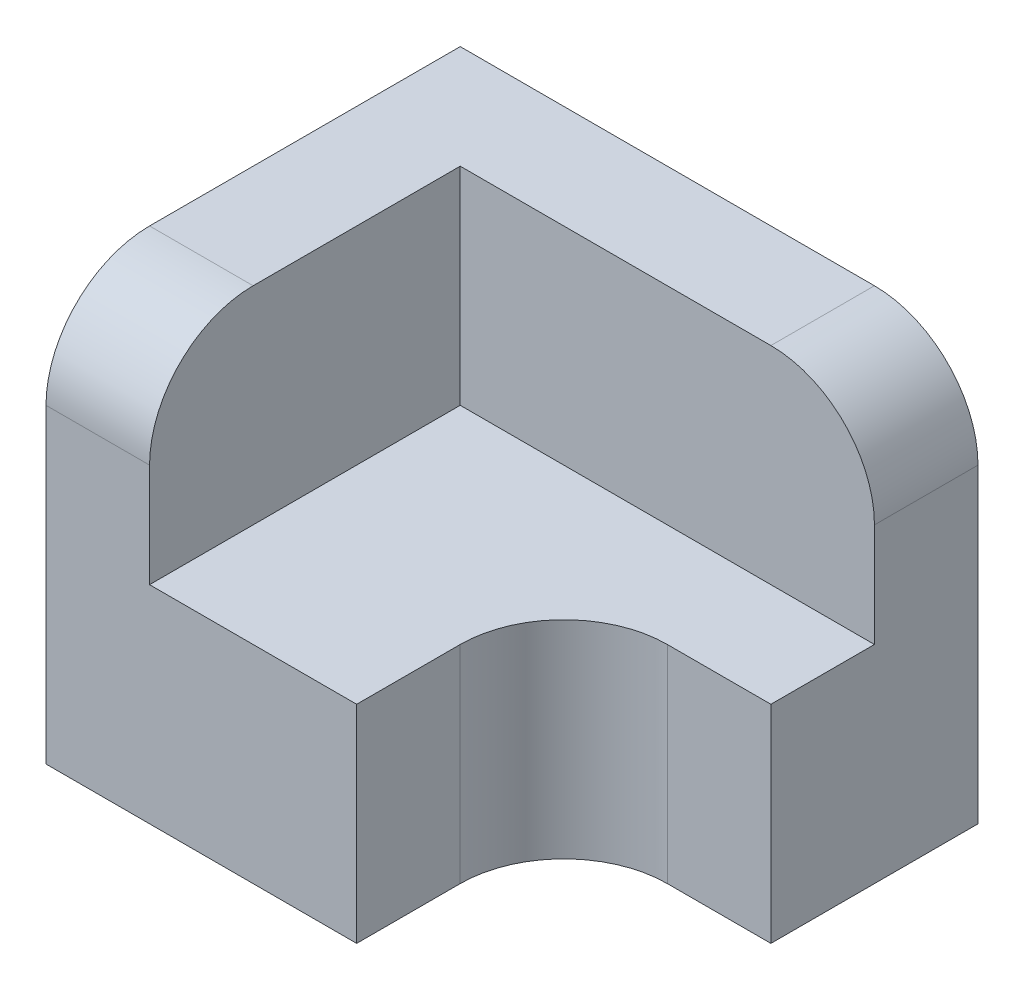
ISO-10303-21;
HEADER;
FILE_DESCRIPTION(('STEP AP214'),'2;1');
FILE_NAME('part.step','',(''),(''),'','','');
FILE_SCHEMA(('AUTOMOTIVE_DESIGN { 1 0 10303 214 1 1 1 1 }'));
ENDSEC;
DATA;
#1=APPLICATION_CONTEXT('core data for automotive mechanical design processes');
#2=APPLICATION_PROTOCOL_DEFINITION('international standard','automotive_design',2000,#1);
#3=PRODUCT_CONTEXT('',#1,'mechanical');
#4=PRODUCT('Part','Part','',(#3));
#5=PRODUCT_RELATED_PRODUCT_CATEGORY('part','',(#4));
#6=PRODUCT_DEFINITION_FORMATION('','',#4);
#7=PRODUCT_DEFINITION_CONTEXT('part definition',#1,'design');
#8=PRODUCT_DEFINITION('design','',#6,#7);
#9=PRODUCT_DEFINITION_SHAPE('','',#8);
#10=(LENGTH_UNIT() NAMED_UNIT(*) SI_UNIT(.MILLI.,.METRE.));
#11=(NAMED_UNIT(*) PLANE_ANGLE_UNIT() SI_UNIT($,.RADIAN.));
#12=(NAMED_UNIT(*) SI_UNIT($,.STERADIAN.) SOLID_ANGLE_UNIT());
#13=UNCERTAINTY_MEASURE_WITH_UNIT(LENGTH_MEASURE(1.E-05),#10,'distance_accuracy_value','');
#14=(GEOMETRIC_REPRESENTATION_CONTEXT(3) GLOBAL_UNCERTAINTY_ASSIGNED_CONTEXT((#13)) GLOBAL_UNIT_ASSIGNED_CONTEXT((#10,
#11,#12)) REPRESENTATION_CONTEXT('',''));
#15=CARTESIAN_POINT('',(0.,0.,0.));
#16=DIRECTION('',(0.,0.,1.));
#17=DIRECTION('',(1.,0.,0.));
#18=AXIS2_PLACEMENT_3D('',#15,#16,#17);
#19=CARTESIAN_POINT('',(0.,10.,0.));
#20=DIRECTION('',(0.,1.,0.));
#21=DIRECTION('',(0.,0.,1.));
#22=AXIS2_PLACEMENT_3D('',#19,#20,#21);
#23=PLANE('',#22);
#24=DIRECTION('',(-1.,0.,0.));
#25=VECTOR('',#24,1.);
#26=CARTESIAN_POINT('',(0.,10.,-5.));
#27=LINE('',#26,#25);
#28=CARTESIAN_POINT('',(12.5,10.,-5.));
#29=VERTEX_POINT('',#28);
#30=CARTESIAN_POINT('',(-7.5,10.,-5.));
#31=VERTEX_POINT('',#30);
#32=EDGE_CURVE('E151',#29,#31,#27,.T.);
#33=ORIENTED_EDGE('',*,*,#32,.T.);
#34=DIRECTION('',(0.,0.,1.));
#35=VECTOR('',#34,1.);
#36=CARTESIAN_POINT('',(-7.5,10.,0.));
#37=LINE('',#36,#35);
#38=CARTESIAN_POINT('',(-7.5,10.,10.));
#39=VERTEX_POINT('',#38);
#40=EDGE_CURVE('E150',#31,#39,#37,.T.);
#41=ORIENTED_EDGE('',*,*,#40,.T.);
#42=DIRECTION('',(1.,0.,0.));
#43=VECTOR('',#42,1.);
#44=CARTESIAN_POINT('',(0.,10.,10.));
#45=LINE('',#44,#43);
#46=CARTESIAN_POINT('',(2.5,10.,10.));
#47=VERTEX_POINT('',#46);
#48=EDGE_CURVE('E164',#39,#47,#45,.T.);
#49=ORIENTED_EDGE('',*,*,#48,.T.);
#50=DIRECTION('',(0.,0.,-1.));
#51=VECTOR('',#50,1.);
#52=CARTESIAN_POINT('',(2.5,10.,0.));
#53=LINE('',#52,#51);
#54=CARTESIAN_POINT('',(2.5,10.,5.00000000000004));
#55=VERTEX_POINT('',#54);
#56=EDGE_CURVE('E167',#47,#55,#53,.T.);
#57=ORIENTED_EDGE('',*,*,#56,.T.);
#58=CARTESIAN_POINT('',(7.5,10.,5.));
#59=DIRECTION('',(0.,1.,0.));
#60=DIRECTION('',(0.,0.,1.));
#61=AXIS2_PLACEMENT_3D('',#58,#59,#60);
#62=CIRCLE('',#61,5.);
#63=CARTESIAN_POINT('',(7.50000000000003,10.,0.));
#64=VERTEX_POINT('',#63);
#65=EDGE_CURVE('E169',#55,#64,#62,.F.);
#66=ORIENTED_EDGE('',*,*,#65,.T.);
#67=DIRECTION('',(-1.,0.,0.));
#68=VECTOR('',#67,1.);
#69=CARTESIAN_POINT('',(0.,10.,0.));
#70=LINE('',#69,#68);
#71=CARTESIAN_POINT('',(12.5,10.,0.));
#72=VERTEX_POINT('',#71);
#73=EDGE_CURVE('E171',#72,#64,#70,.T.);
#74=ORIENTED_EDGE('',*,*,#73,.F.);
#75=DIRECTION('',(0.,0.,-1.));
#76=VECTOR('',#75,1.);
#77=CARTESIAN_POINT('',(12.5,10.,0.));
#78=LINE('',#77,#76);
#79=EDGE_CURVE('E161',#72,#29,#78,.T.);
#80=ORIENTED_EDGE('',*,*,#79,.T.);
#81=EDGE_LOOP('',(#33,#41,#49,#57,#66,#74,#80));
#82=FACE_BOUND('',#81,.T.);
#83=ADVANCED_FACE('F39',(#82),#23,.T.);
#84=CARTESIAN_POINT('',(12.5,10.,0.));
#85=DIRECTION('',(-1.,0.,0.));
#86=DIRECTION('',(0.,0.,1.));
#87=AXIS2_PLACEMENT_3D('',#84,#85,#86);
#88=PLANE('',#87);
#89=DIRECTION('',(0.,-1.,0.));
#90=VECTOR('',#89,1.);
#91=CARTESIAN_POINT('',(12.5,10.,-10.));
#92=LINE('',#91,#90);
#93=CARTESIAN_POINT('',(12.5,15.,-10.));
#94=VERTEX_POINT('',#93);
#95=CARTESIAN_POINT('',(12.5,0.,-10.));
#96=VERTEX_POINT('',#95);
#97=EDGE_CURVE('E205',#94,#96,#92,.T.);
#98=ORIENTED_EDGE('',*,*,#97,.F.);
#99=DIRECTION('',(0.,0.,-1.));
#100=VECTOR('',#99,1.);
#101=CARTESIAN_POINT('',(12.5,15.,-5.));
#102=LINE('',#101,#100);
#103=CARTESIAN_POINT('',(12.5,15.,-5.));
#104=VERTEX_POINT('',#103);
#105=EDGE_CURVE('E47',#94,#104,#102,.F.);
#106=ORIENTED_EDGE('',*,*,#105,.T.);
#107=DIRECTION('',(0.,-1.,0.));
#108=VECTOR('',#107,1.);
#109=CARTESIAN_POINT('',(12.5,20.,-5.));
#110=LINE('',#109,#108);
#111=EDGE_CURVE('E152',#104,#29,#110,.T.);
#112=ORIENTED_EDGE('',*,*,#111,.T.);
#113=ORIENTED_EDGE('',*,*,#79,.F.);
#114=DIRECTION('',(0.,-1.,0.));
#115=VECTOR('',#114,1.);
#116=CARTESIAN_POINT('',(12.5,10.,0.));
#117=LINE('',#116,#115);
#118=CARTESIAN_POINT('',(12.5,0.,0.));
#119=VERTEX_POINT('',#118);
#120=EDGE_CURVE('E174',#72,#119,#117,.T.);
#121=ORIENTED_EDGE('',*,*,#120,.T.);
#122=DIRECTION('',(0.,0.,-1.));
#123=VECTOR('',#122,1.);
#124=CARTESIAN_POINT('',(12.5,0.,0.));
#125=LINE('',#124,#123);
#126=EDGE_CURVE('E160',#119,#96,#125,.T.);
#127=ORIENTED_EDGE('',*,*,#126,.T.);
#128=EDGE_LOOP('',(#98,#106,#112,#113,#121,#127));
#129=FACE_BOUND('',#128,.T.);
#130=ADVANCED_FACE('F257',(#129),#88,.F.);
#131=CARTESIAN_POINT('',(0.,10.,-10.));
#132=DIRECTION('',(0.,0.,-1.));
#133=DIRECTION('',(-1.,0.,0.));
#134=AXIS2_PLACEMENT_3D('',#131,#132,#133);
#135=PLANE('',#134);
#136=DIRECTION('',(1.,0.,0.));
#137=VECTOR('',#136,1.);
#138=CARTESIAN_POINT('',(0.,20.,-10.));
#139=LINE('',#138,#137);
#140=CARTESIAN_POINT('',(-12.5,20.,-10.));
#141=VERTEX_POINT('',#140);
#142=CARTESIAN_POINT('',(7.5,20.,-10.));
#143=VERTEX_POINT('',#142);
#144=EDGE_CURVE('E145',#141,#143,#139,.T.);
#145=ORIENTED_EDGE('',*,*,#144,.T.);
#146=CARTESIAN_POINT('',(7.5,15.,-10.));
#147=DIRECTION('',(0.,0.,-1.));
#148=DIRECTION('',(-1.,0.,0.));
#149=AXIS2_PLACEMENT_3D('',#146,#147,#148);
#150=CIRCLE('',#149,5.);
#151=EDGE_CURVE('E61',#143,#94,#150,.T.);
#152=ORIENTED_EDGE('',*,*,#151,.T.);
#153=ORIENTED_EDGE('',*,*,#97,.T.);
#154=DIRECTION('',(1.,0.,0.));
#155=VECTOR('',#154,1.);
#156=CARTESIAN_POINT('',(0.,0.,-10.));
#157=LINE('',#156,#155);
#158=CARTESIAN_POINT('',(-12.5,0.,-10.));
#159=VERTEX_POINT('',#158);
#160=EDGE_CURVE('E177',#159,#96,#157,.T.);
#161=ORIENTED_EDGE('',*,*,#160,.F.);
#162=DIRECTION('',(0.,-1.,0.));
#163=VECTOR('',#162,1.);
#164=CARTESIAN_POINT('',(-12.5,10.,-10.));
#165=LINE('',#164,#163);
#166=EDGE_CURVE('E203',#141,#159,#165,.T.);
#167=ORIENTED_EDGE('',*,*,#166,.F.);
#168=EDGE_LOOP('',(#145,#152,#153,#161,#167));
#169=FACE_BOUND('',#168,.T.);
#170=ADVANCED_FACE('F234',(#169),#135,.T.);
#171=CARTESIAN_POINT('',(-12.5,10.,0.));
#172=DIRECTION('',(-1.,0.,0.));
#173=DIRECTION('',(0.,0.,1.));
#174=AXIS2_PLACEMENT_3D('',#171,#172,#173);
#175=PLANE('',#174);
#176=DIRECTION('',(0.,-1.,0.));
#177=VECTOR('',#176,1.);
#178=CARTESIAN_POINT('',(-12.5,10.,10.));
#179=LINE('',#178,#177);
#180=CARTESIAN_POINT('',(-12.5,15.,10.));
#181=VERTEX_POINT('',#180);
#182=CARTESIAN_POINT('',(-12.5,0.,10.));
#183=VERTEX_POINT('',#182);
#184=EDGE_CURVE('E201',#181,#183,#179,.T.);
#185=ORIENTED_EDGE('',*,*,#184,.F.);
#186=CARTESIAN_POINT('',(-12.5,15.,5.));
#187=DIRECTION('',(-1.,0.,0.));
#188=DIRECTION('',(0.,0.,1.));
#189=AXIS2_PLACEMENT_3D('',#186,#187,#188);
#190=CIRCLE('',#189,5.);
#191=CARTESIAN_POINT('',(-12.5,20.,5.));
#192=VERTEX_POINT('',#191);
#193=EDGE_CURVE('E214',#181,#192,#190,.T.);
#194=ORIENTED_EDGE('',*,*,#193,.T.);
#195=DIRECTION('',(0.,0.,-1.));
#196=VECTOR('',#195,1.);
#197=CARTESIAN_POINT('',(-12.5,20.,0.));
#198=LINE('',#197,#196);
#199=EDGE_CURVE('E220',#192,#141,#198,.T.);
#200=ORIENTED_EDGE('',*,*,#199,.T.);
#201=ORIENTED_EDGE('',*,*,#166,.T.);
#202=DIRECTION('',(0.,0.,-1.));
#203=VECTOR('',#202,1.);
#204=CARTESIAN_POINT('',(-12.5,0.,0.));
#205=LINE('',#204,#203);
#206=EDGE_CURVE('E180',#183,#159,#205,.T.);
#207=ORIENTED_EDGE('',*,*,#206,.F.);
#208=EDGE_LOOP('',(#185,#194,#200,#201,#207));
#209=FACE_BOUND('',#208,.T.);
#210=ADVANCED_FACE('F219',(#209),#175,.T.);
#211=CARTESIAN_POINT('',(0.,10.,10.));
#212=DIRECTION('',(0.,0.,-1.));
#213=DIRECTION('',(-1.,0.,0.));
#214=AXIS2_PLACEMENT_3D('',#211,#212,#213);
#215=PLANE('',#214);
#216=DIRECTION('',(0.,-1.,0.));
#217=VECTOR('',#216,1.);
#218=CARTESIAN_POINT('',(-7.5,20.,10.));
#219=LINE('',#218,#217);
#220=CARTESIAN_POINT('',(-7.5,15.,10.));
#221=VERTEX_POINT('',#220);
#222=EDGE_CURVE('E155',#221,#39,#219,.T.);
#223=ORIENTED_EDGE('',*,*,#222,.F.);
#224=DIRECTION('',(1.,0.,0.));
#225=VECTOR('',#224,1.);
#226=CARTESIAN_POINT('',(-12.5,15.,10.));
#227=LINE('',#226,#225);
#228=EDGE_CURVE('E212',#221,#181,#227,.F.);
#229=ORIENTED_EDGE('',*,*,#228,.T.);
#230=ORIENTED_EDGE('',*,*,#184,.T.);
#231=DIRECTION('',(1.,0.,0.));
#232=VECTOR('',#231,1.);
#233=CARTESIAN_POINT('',(0.,0.,10.));
#234=LINE('',#233,#232);
#235=CARTESIAN_POINT('',(2.5,0.,10.));
#236=VERTEX_POINT('',#235);
#237=EDGE_CURVE('E183',#183,#236,#234,.T.);
#238=ORIENTED_EDGE('',*,*,#237,.T.);
#239=DIRECTION('',(0.,-1.,0.));
#240=VECTOR('',#239,1.);
#241=CARTESIAN_POINT('',(2.5,10.,10.));
#242=LINE('',#241,#240);
#243=EDGE_CURVE('E198',#47,#236,#242,.T.);
#244=ORIENTED_EDGE('',*,*,#243,.F.);
#245=ORIENTED_EDGE('',*,*,#48,.F.);
#246=EDGE_LOOP('',(#223,#229,#230,#238,#244,#245));
#247=FACE_BOUND('',#246,.T.);
#248=ADVANCED_FACE('F231',(#247),#215,.F.);
#249=CARTESIAN_POINT('',(2.5,10.,0.));
#250=DIRECTION('',(-1.,0.,0.));
#251=DIRECTION('',(0.,0.,1.));
#252=AXIS2_PLACEMENT_3D('',#249,#250,#251);
#253=PLANE('',#252);
#254=DIRECTION('',(0.,0.,-1.));
#255=VECTOR('',#254,1.);
#256=CARTESIAN_POINT('',(2.5,0.,0.));
#257=LINE('',#256,#255);
#258=CARTESIAN_POINT('',(2.5,0.,5.00000000000004));
#259=VERTEX_POINT('',#258);
#260=EDGE_CURVE('E185',#236,#259,#257,.T.);
#261=ORIENTED_EDGE('',*,*,#260,.T.);
#262=DIRECTION('',(0.,-1.,0.));
#263=VECTOR('',#262,1.);
#264=CARTESIAN_POINT('',(2.5,10.,5.00000000000004));
#265=LINE('',#264,#263);
#266=EDGE_CURVE('E195',#55,#259,#265,.T.);
#267=ORIENTED_EDGE('',*,*,#266,.F.);
#268=ORIENTED_EDGE('',*,*,#56,.F.);
#269=ORIENTED_EDGE('',*,*,#243,.T.);
#270=EDGE_LOOP('',(#261,#267,#268,#269));
#271=FACE_BOUND('',#270,.T.);
#272=ADVANCED_FACE('F244',(#271),#253,.F.);
#273=CARTESIAN_POINT('',(7.5,10.,5.));
#274=DIRECTION('',(0.,-1.,0.));
#275=DIRECTION('',(0.,0.,-1.));
#276=AXIS2_PLACEMENT_3D('',#273,#274,#275);
#277=CYLINDRICAL_SURFACE('',#276,5.);
#278=CARTESIAN_POINT('',(7.5,0.,5.));
#279=DIRECTION('',(0.,1.,0.));
#280=DIRECTION('',(0.,0.,1.));
#281=AXIS2_PLACEMENT_3D('',#278,#279,#280);
#282=CIRCLE('',#281,5.);
#283=CARTESIAN_POINT('',(7.50000000000003,0.,0.));
#284=VERTEX_POINT('',#283);
#285=EDGE_CURVE('E187',#259,#284,#282,.F.);
#286=ORIENTED_EDGE('',*,*,#285,.T.);
#287=DIRECTION('',(0.,-1.,0.));
#288=VECTOR('',#287,1.);
#289=CARTESIAN_POINT('',(7.50000000000003,10.,0.));
#290=LINE('',#289,#288);
#291=EDGE_CURVE('E193',#64,#284,#290,.T.);
#292=ORIENTED_EDGE('',*,*,#291,.F.);
#293=ORIENTED_EDGE('',*,*,#65,.F.);
#294=ORIENTED_EDGE('',*,*,#266,.T.);
#295=EDGE_LOOP('',(#286,#292,#293,#294));
#296=FACE_BOUND('',#295,.T.);
#297=ADVANCED_FACE('F271',(#296),#277,.F.);
#298=CARTESIAN_POINT('',(0.,10.,0.));
#299=DIRECTION('',(0.,0.,1.));
#300=DIRECTION('',(1.,0.,0.));
#301=AXIS2_PLACEMENT_3D('',#298,#299,#300);
#302=PLANE('',#301);
#303=DIRECTION('',(-1.,0.,0.));
#304=VECTOR('',#303,1.);
#305=CARTESIAN_POINT('',(0.,0.,0.));
#306=LINE('',#305,#304);
#307=EDGE_CURVE('E165',#119,#284,#306,.T.);
#308=ORIENTED_EDGE('',*,*,#307,.F.);
#309=ORIENTED_EDGE('',*,*,#120,.F.);
#310=ORIENTED_EDGE('',*,*,#73,.T.);
#311=ORIENTED_EDGE('',*,*,#291,.T.);
#312=EDGE_LOOP('',(#308,#309,#310,#311));
#313=FACE_BOUND('',#312,.T.);
#314=ADVANCED_FACE('F268',(#313),#302,.T.);
#315=CARTESIAN_POINT('',(0.,0.,0.));
#316=DIRECTION('',(0.,1.,0.));
#317=DIRECTION('',(0.,0.,1.));
#318=AXIS2_PLACEMENT_3D('',#315,#316,#317);
#319=PLANE('',#318);
#320=ORIENTED_EDGE('',*,*,#260,.F.);
#321=ORIENTED_EDGE('',*,*,#237,.F.);
#322=ORIENTED_EDGE('',*,*,#206,.T.);
#323=ORIENTED_EDGE('',*,*,#160,.T.);
#324=ORIENTED_EDGE('',*,*,#126,.F.);
#325=ORIENTED_EDGE('',*,*,#307,.T.);
#326=ORIENTED_EDGE('',*,*,#285,.F.);
#327=EDGE_LOOP('',(#320,#321,#322,#323,#324,#325,#326));
#328=FACE_BOUND('',#327,.T.);
#329=ADVANCED_FACE('F239',(#328),#319,.F.);
#330=CARTESIAN_POINT('',(-7.5,20.,0.));
#331=DIRECTION('',(-1.,0.,0.));
#332=DIRECTION('',(0.,0.,1.));
#333=AXIS2_PLACEMENT_3D('',#330,#331,#332);
#334=PLANE('',#333);
#335=DIRECTION('',(0.,0.,-1.));
#336=VECTOR('',#335,1.);
#337=CARTESIAN_POINT('',(-7.5,20.,0.));
#338=LINE('',#337,#336);
#339=CARTESIAN_POINT('',(-7.5,20.,5.));
#340=VERTEX_POINT('',#339);
#341=CARTESIAN_POINT('',(-7.5,20.,-5.));
#342=VERTEX_POINT('',#341);
#343=EDGE_CURVE('E127',#340,#342,#338,.T.);
#344=ORIENTED_EDGE('',*,*,#343,.F.);
#345=CARTESIAN_POINT('',(-7.5,15.,5.));
#346=DIRECTION('',(-1.,0.,0.));
#347=DIRECTION('',(0.,0.,1.));
#348=AXIS2_PLACEMENT_3D('',#345,#346,#347);
#349=CIRCLE('',#348,5.);
#350=EDGE_CURVE('E210',#340,#221,#349,.F.);
#351=ORIENTED_EDGE('',*,*,#350,.T.);
#352=ORIENTED_EDGE('',*,*,#222,.T.);
#353=ORIENTED_EDGE('',*,*,#40,.F.);
#354=DIRECTION('',(0.,-1.,0.));
#355=VECTOR('',#354,1.);
#356=CARTESIAN_POINT('',(-7.5,20.,-5.));
#357=LINE('',#356,#355);
#358=EDGE_CURVE('E143',#342,#31,#357,.T.);
#359=ORIENTED_EDGE('',*,*,#358,.F.);
#360=EDGE_LOOP('',(#344,#351,#352,#353,#359));
#361=FACE_BOUND('',#360,.T.);
#362=ADVANCED_FACE('F148',(#361),#334,.F.);
#363=CARTESIAN_POINT('',(0.,20.,-5.));
#364=DIRECTION('',(0.,0.,-1.));
#365=DIRECTION('',(-1.,0.,0.));
#366=AXIS2_PLACEMENT_3D('',#363,#364,#365);
#367=PLANE('',#366);
#368=ORIENTED_EDGE('',*,*,#111,.F.);
#369=CARTESIAN_POINT('',(7.5,15.,-5.));
#370=DIRECTION('',(0.,0.,-1.));
#371=DIRECTION('',(-1.,0.,0.));
#372=AXIS2_PLACEMENT_3D('',#369,#370,#371);
#373=CIRCLE('',#372,5.);
#374=CARTESIAN_POINT('',(7.5,20.,-5.));
#375=VERTEX_POINT('',#374);
#376=EDGE_CURVE('E11',#104,#375,#373,.F.);
#377=ORIENTED_EDGE('',*,*,#376,.T.);
#378=DIRECTION('',(1.,0.,0.));
#379=VECTOR('',#378,1.);
#380=CARTESIAN_POINT('',(0.,20.,-5.));
#381=LINE('',#380,#379);
#382=EDGE_CURVE('E132',#342,#375,#381,.T.);
#383=ORIENTED_EDGE('',*,*,#382,.F.);
#384=ORIENTED_EDGE('',*,*,#358,.T.);
#385=ORIENTED_EDGE('',*,*,#32,.F.);
#386=EDGE_LOOP('',(#368,#377,#383,#384,#385));
#387=FACE_BOUND('',#386,.T.);
#388=ADVANCED_FACE('F141',(#387),#367,.F.);
#389=CARTESIAN_POINT('',(0.,20.,0.));
#390=DIRECTION('',(0.,1.,0.));
#391=DIRECTION('',(0.,0.,1.));
#392=AXIS2_PLACEMENT_3D('',#389,#390,#391);
#393=PLANE('',#392);
#394=ORIENTED_EDGE('',*,*,#199,.F.);
#395=DIRECTION('',(1.,0.,0.));
#396=VECTOR('',#395,1.);
#397=CARTESIAN_POINT('',(-7.5,20.,5.));
#398=LINE('',#397,#396);
#399=EDGE_CURVE('E135',#192,#340,#398,.T.);
#400=ORIENTED_EDGE('',*,*,#399,.T.);
#401=ORIENTED_EDGE('',*,*,#343,.T.);
#402=ORIENTED_EDGE('',*,*,#382,.T.);
#403=DIRECTION('',(0.,0.,-1.));
#404=VECTOR('',#403,1.);
#405=CARTESIAN_POINT('',(7.5,20.,-10.));
#406=LINE('',#405,#404);
#407=EDGE_CURVE('E207',#375,#143,#406,.T.);
#408=ORIENTED_EDGE('',*,*,#407,.T.);
#409=ORIENTED_EDGE('',*,*,#144,.F.);
#410=EDGE_LOOP('',(#394,#400,#401,#402,#408,#409));
#411=FACE_BOUND('',#410,.T.);
#412=ADVANCED_FACE('F130',(#411),#393,.T.);
#413=CARTESIAN_POINT('',(0.,15.,5.));
#414=DIRECTION('',(-1.,0.,0.));
#415=DIRECTION('',(0.,0.,1.));
#416=AXIS2_PLACEMENT_3D('',#413,#414,#415);
#417=CYLINDRICAL_SURFACE('',#416,5.);
#418=ORIENTED_EDGE('',*,*,#193,.F.);
#419=ORIENTED_EDGE('',*,*,#228,.F.);
#420=ORIENTED_EDGE('',*,*,#350,.F.);
#421=ORIENTED_EDGE('',*,*,#399,.F.);
#422=EDGE_LOOP('',(#418,#419,#420,#421));
#423=FACE_BOUND('',#422,.T.);
#424=ADVANCED_FACE('F227',(#423),#417,.T.);
#425=CARTESIAN_POINT('',(7.5,15.,0.));
#426=DIRECTION('',(0.,0.,1.));
#427=DIRECTION('',(1.,0.,0.));
#428=AXIS2_PLACEMENT_3D('',#425,#426,#427);
#429=CYLINDRICAL_SURFACE('',#428,5.);
#430=ORIENTED_EDGE('',*,*,#376,.F.);
#431=ORIENTED_EDGE('',*,*,#105,.F.);
#432=ORIENTED_EDGE('',*,*,#151,.F.);
#433=ORIENTED_EDGE('',*,*,#407,.F.);
#434=EDGE_LOOP('',(#430,#431,#432,#433));
#435=FACE_BOUND('',#434,.T.);
#436=ADVANCED_FACE('F41',(#435),#429,.T.);
#437=CLOSED_SHELL('',(#83,#130,#170,#210,#248,#272,#297,#314,#329,#362,#388,#412,#424,#436));
#438=MANIFOLD_SOLID_BREP('B2',#437);
#439=ADVANCED_BREP_SHAPE_REPRESENTATION('',(#18,#438),#14);
#440=SHAPE_DEFINITION_REPRESENTATION(#9,#439);
ENDSEC;
END-ISO-10303-21;
